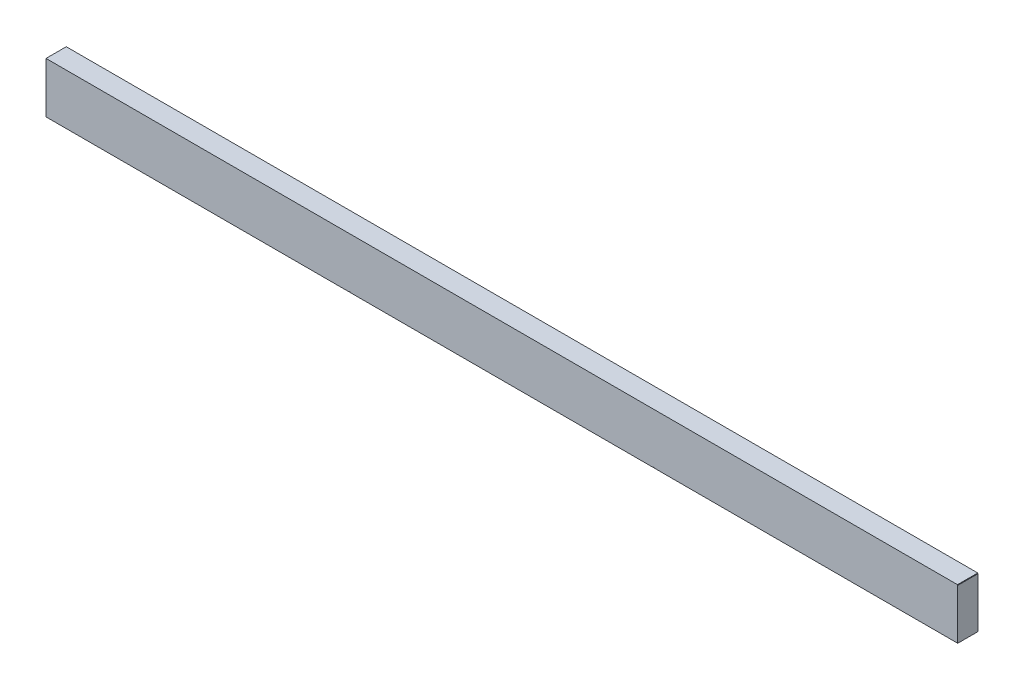
ISO-10303-21;
HEADER;
FILE_DESCRIPTION(('STEP AP214'),'2;1');
FILE_NAME('part.step','',(''),(''),'','','');
FILE_SCHEMA(('AUTOMOTIVE_DESIGN { 1 0 10303 214 1 1 1 1 }'));
ENDSEC;
DATA;
#1=APPLICATION_CONTEXT('core data for automotive mechanical design processes');
#2=APPLICATION_PROTOCOL_DEFINITION('international standard','automotive_design',2000,#1);
#3=PRODUCT_CONTEXT('',#1,'mechanical');
#4=PRODUCT('Part','Part','',(#3));
#5=PRODUCT_RELATED_PRODUCT_CATEGORY('part','',(#4));
#6=PRODUCT_DEFINITION_FORMATION('','',#4);
#7=PRODUCT_DEFINITION_CONTEXT('part definition',#1,'design');
#8=PRODUCT_DEFINITION('design','',#6,#7);
#9=PRODUCT_DEFINITION_SHAPE('','',#8);
#10=(LENGTH_UNIT() NAMED_UNIT(*) SI_UNIT(.MILLI.,.METRE.));
#11=(NAMED_UNIT(*) PLANE_ANGLE_UNIT() SI_UNIT($,.RADIAN.));
#12=(NAMED_UNIT(*) SI_UNIT($,.STERADIAN.) SOLID_ANGLE_UNIT());
#13=UNCERTAINTY_MEASURE_WITH_UNIT(LENGTH_MEASURE(1.E-05),#10,'distance_accuracy_value','');
#14=(GEOMETRIC_REPRESENTATION_CONTEXT(3) GLOBAL_UNCERTAINTY_ASSIGNED_CONTEXT((#13)) GLOBAL_UNIT_ASSIGNED_CONTEXT((#10,
#11,#12)) REPRESENTATION_CONTEXT('',''));
#15=CARTESIAN_POINT('',(0.,0.,0.));
#16=DIRECTION('',(0.,0.,1.));
#17=DIRECTION('',(1.,0.,0.));
#18=AXIS2_PLACEMENT_3D('',#15,#16,#17);
#19=CARTESIAN_POINT('',(9000.,-250.,100.));
#20=DIRECTION('',(0.,1.,0.));
#21=DIRECTION('',(0.,0.,1.));
#22=AXIS2_PLACEMENT_3D('',#19,#20,#21);
#23=PLANE('',#22);
#24=DIRECTION('',(-1.,0.,0.));
#25=VECTOR('',#24,1.);
#26=CARTESIAN_POINT('',(9000.,-250.,100.));
#27=LINE('',#26,#25);
#28=CARTESIAN_POINT('',(5997.5,-250.,100.));
#29=VERTEX_POINT('',#28);
#30=CARTESIAN_POINT('',(3002.5,-250.,100.));
#31=VERTEX_POINT('',#30);
#32=EDGE_CURVE('E269',#29,#31,#27,.T.);
#33=ORIENTED_EDGE('',*,*,#32,.T.);
#34=DIRECTION('',(0.,0.,-1.));
#35=VECTOR('',#34,1.);
#36=CARTESIAN_POINT('',(3002.5,-250.,100.));
#37=LINE('',#36,#35);
#38=CARTESIAN_POINT('',(3002.5,-250.,-100.));
#39=VERTEX_POINT('',#38);
#40=EDGE_CURVE('E11',#31,#39,#37,.T.);
#41=ORIENTED_EDGE('',*,*,#40,.T.);
#42=DIRECTION('',(-1.,0.,0.));
#43=VECTOR('',#42,1.);
#44=CARTESIAN_POINT('',(9000.,-250.,-100.));
#45=LINE('',#44,#43);
#46=CARTESIAN_POINT('',(5997.5,-250.,-100.));
#47=VERTEX_POINT('',#46);
#48=EDGE_CURVE('E168',#47,#39,#45,.T.);
#49=ORIENTED_EDGE('',*,*,#48,.F.);
#50=DIRECTION('',(0.,0.,1.));
#51=VECTOR('',#50,1.);
#52=CARTESIAN_POINT('',(5997.5,-250.,100.));
#53=LINE('',#52,#51);
#54=EDGE_CURVE('E279',#47,#29,#53,.T.);
#55=ORIENTED_EDGE('',*,*,#54,.T.);
#56=EDGE_LOOP('',(#33,#41,#49,#55));
#57=FACE_BOUND('',#56,.T.);
#58=ADVANCED_FACE('F42',(#57),#23,.F.);
#59=CARTESIAN_POINT('',(9000.,-250.,100.));
#60=VERTEX_POINT('',#59);
#61=CARTESIAN_POINT('',(6002.5,-250.,100.));
#62=VERTEX_POINT('',#61);
#63=EDGE_CURVE('E264',#60,#62,#27,.T.);
#64=ORIENTED_EDGE('',*,*,#63,.T.);
#65=DIRECTION('',(0.,0.,-1.));
#66=VECTOR('',#65,1.);
#67=CARTESIAN_POINT('',(6002.5,-250.,100.));
#68=LINE('',#67,#66);
#69=CARTESIAN_POINT('',(6002.5,-250.,-100.));
#70=VERTEX_POINT('',#69);
#71=EDGE_CURVE('E282',#62,#70,#68,.T.);
#72=ORIENTED_EDGE('',*,*,#71,.T.);
#73=CARTESIAN_POINT('',(9000.,-250.,-100.));
#74=VERTEX_POINT('',#73);
#75=EDGE_CURVE('E259',#74,#70,#45,.T.);
#76=ORIENTED_EDGE('',*,*,#75,.F.);
#77=DIRECTION('',(0.,0.,-1.));
#78=VECTOR('',#77,1.);
#79=CARTESIAN_POINT('',(9000.,-250.,100.));
#80=LINE('',#79,#78);
#81=EDGE_CURVE('E241',#60,#74,#80,.T.);
#82=ORIENTED_EDGE('',*,*,#81,.F.);
#83=EDGE_LOOP('',(#64,#72,#76,#82));
#84=FACE_BOUND('',#83,.T.);
#85=ADVANCED_FACE('F310',(#84),#23,.F.);
#86=CARTESIAN_POINT('',(9000.,-250.,-100.));
#87=DIRECTION('',(0.,0.,1.));
#88=DIRECTION('',(1.,0.,0.));
#89=AXIS2_PLACEMENT_3D('',#86,#87,#88);
#90=PLANE('',#89);
#91=ORIENTED_EDGE('',*,*,#48,.T.);
#92=DIRECTION('',(0.,1.,0.));
#93=VECTOR('',#92,1.);
#94=CARTESIAN_POINT('',(3002.5,-255.,-100.));
#95=LINE('',#94,#93);
#96=CARTESIAN_POINT('',(3002.5,-245.,-100.));
#97=VERTEX_POINT('',#96);
#98=EDGE_CURVE('E147',#39,#97,#95,.T.);
#99=ORIENTED_EDGE('',*,*,#98,.T.);
#100=DIRECTION('',(-1.,0.,0.));
#101=VECTOR('',#100,1.);
#102=CARTESIAN_POINT('',(2997.5,-245.,-100.));
#103=LINE('',#102,#101);
#104=CARTESIAN_POINT('',(2997.5,-245.,-100.));
#105=VERTEX_POINT('',#104);
#106=EDGE_CURVE('E158',#97,#105,#103,.T.);
#107=ORIENTED_EDGE('',*,*,#106,.T.);
#108=DIRECTION('',(0.,-1.,0.));
#109=VECTOR('',#108,1.);
#110=CARTESIAN_POINT('',(2997.5,-255.,-100.));
#111=LINE('',#110,#109);
#112=CARTESIAN_POINT('',(2997.5,-250.,-100.));
#113=VERTEX_POINT('',#112);
#114=EDGE_CURVE('E155',#105,#113,#111,.T.);
#115=ORIENTED_EDGE('',*,*,#114,.T.);
#116=CARTESIAN_POINT('',(0.,-250.,-100.));
#117=VERTEX_POINT('',#116);
#118=EDGE_CURVE('E244',#113,#117,#45,.T.);
#119=ORIENTED_EDGE('',*,*,#118,.T.);
#120=DIRECTION('',(0.,1.,0.));
#121=VECTOR('',#120,1.);
#122=CARTESIAN_POINT('',(0.,-250.,-100.));
#123=LINE('',#122,#121);
#124=CARTESIAN_POINT('',(0.,250.,-100.));
#125=VERTEX_POINT('',#124);
#126=EDGE_CURVE('E232',#117,#125,#123,.T.);
#127=ORIENTED_EDGE('',*,*,#126,.T.);
#128=DIRECTION('',(-1.,0.,0.));
#129=VECTOR('',#128,1.);
#130=CARTESIAN_POINT('',(9000.,250.,-100.));
#131=LINE('',#130,#129);
#132=CARTESIAN_POINT('',(8997.5,250.,-100.));
#133=VERTEX_POINT('',#132);
#134=EDGE_CURVE('E272',#133,#125,#131,.T.);
#135=ORIENTED_EDGE('',*,*,#134,.F.);
#136=DIRECTION('',(0.,-1.,0.));
#137=VECTOR('',#136,1.);
#138=CARTESIAN_POINT('',(8997.5,245.,-100.));
#139=LINE('',#138,#137);
#140=CARTESIAN_POINT('',(8997.5,245.,-100.));
#141=VERTEX_POINT('',#140);
#142=EDGE_CURVE('E220',#133,#141,#139,.T.);
#143=ORIENTED_EDGE('',*,*,#142,.T.);
#144=DIRECTION('',(1.,0.,0.));
#145=VECTOR('',#144,1.);
#146=CARTESIAN_POINT('',(8997.5,245.,-100.));
#147=LINE('',#146,#145);
#148=CARTESIAN_POINT('',(9000.,245.,-100.));
#149=VERTEX_POINT('',#148);
#150=EDGE_CURVE('E216',#141,#149,#147,.T.);
#151=ORIENTED_EDGE('',*,*,#150,.T.);
#152=DIRECTION('',(0.,1.,0.));
#153=VECTOR('',#152,1.);
#154=CARTESIAN_POINT('',(9000.,-250.,-100.));
#155=LINE('',#154,#153);
#156=EDGE_CURVE('E233',#74,#149,#155,.T.);
#157=ORIENTED_EDGE('',*,*,#156,.F.);
#158=ORIENTED_EDGE('',*,*,#75,.T.);
#159=DIRECTION('',(0.,1.,0.));
#160=VECTOR('',#159,1.);
#161=CARTESIAN_POINT('',(6002.5,-255.000000000001,-100.));
#162=LINE('',#161,#160);
#163=CARTESIAN_POINT('',(6002.5,-245.000000000001,-100.));
#164=VERTEX_POINT('',#163);
#165=EDGE_CURVE('E197',#70,#164,#162,.T.);
#166=ORIENTED_EDGE('',*,*,#165,.T.);
#167=DIRECTION('',(-1.,0.,0.));
#168=VECTOR('',#167,1.);
#169=CARTESIAN_POINT('',(5997.5,-245.000000000001,-100.));
#170=LINE('',#169,#168);
#171=CARTESIAN_POINT('',(5997.5,-245.000000000001,-100.));
#172=VERTEX_POINT('',#171);
#173=EDGE_CURVE('E205',#164,#172,#170,.T.);
#174=ORIENTED_EDGE('',*,*,#173,.T.);
#175=DIRECTION('',(0.,-1.,0.));
#176=VECTOR('',#175,1.);
#177=CARTESIAN_POINT('',(5997.5,-255.000000000001,-100.));
#178=LINE('',#177,#176);
#179=EDGE_CURVE('E189',#172,#47,#178,.T.);
#180=ORIENTED_EDGE('',*,*,#179,.T.);
#181=EDGE_LOOP('',(#91,#99,#107,#115,#119,#127,#135,#143,#151,#157,#158,#166,#174,#180));
#182=FACE_BOUND('',#181,.T.);
#183=ADVANCED_FACE('F44',(#182),#90,.F.);
#184=CARTESIAN_POINT('',(9000.,250.,100.));
#185=DIRECTION('',(0.,-1.,0.));
#186=DIRECTION('',(0.,0.,-1.));
#187=AXIS2_PLACEMENT_3D('',#184,#185,#186);
#188=PLANE('',#187);
#189=DIRECTION('',(-1.,0.,0.));
#190=VECTOR('',#189,1.);
#191=CARTESIAN_POINT('',(9000.,250.,100.));
#192=LINE('',#191,#190);
#193=CARTESIAN_POINT('',(8997.5,250.,100.));
#194=VERTEX_POINT('',#193);
#195=CARTESIAN_POINT('',(0.,250.,100.));
#196=VERTEX_POINT('',#195);
#197=EDGE_CURVE('E268',#194,#196,#192,.T.);
#198=ORIENTED_EDGE('',*,*,#197,.F.);
#199=DIRECTION('',(0.,0.,-1.));
#200=VECTOR('',#199,1.);
#201=CARTESIAN_POINT('',(8997.5,250.,100.));
#202=LINE('',#201,#200);
#203=EDGE_CURVE('E183',#194,#133,#202,.T.);
#204=ORIENTED_EDGE('',*,*,#203,.T.);
#205=ORIENTED_EDGE('',*,*,#134,.T.);
#206=DIRECTION('',(0.,0.,1.));
#207=VECTOR('',#206,1.);
#208=CARTESIAN_POINT('',(0.,250.,100.));
#209=LINE('',#208,#207);
#210=EDGE_CURVE('E248',#125,#196,#209,.T.);
#211=ORIENTED_EDGE('',*,*,#210,.T.);
#212=EDGE_LOOP('',(#198,#204,#205,#211));
#213=FACE_BOUND('',#212,.T.);
#214=ADVANCED_FACE('F326',(#213),#188,.F.);
#215=CARTESIAN_POINT('',(9000.,-250.,100.));
#216=DIRECTION('',(0.,0.,-1.));
#217=DIRECTION('',(-1.,0.,0.));
#218=AXIS2_PLACEMENT_3D('',#215,#216,#217);
#219=PLANE('',#218);
#220=DIRECTION('',(-1.,0.,0.));
#221=VECTOR('',#220,1.);
#222=CARTESIAN_POINT('',(2997.5,-245.,100.));
#223=LINE('',#222,#221);
#224=CARTESIAN_POINT('',(3002.5,-245.,100.));
#225=VERTEX_POINT('',#224);
#226=CARTESIAN_POINT('',(2997.5,-245.,100.));
#227=VERTEX_POINT('',#226);
#228=EDGE_CURVE('E172',#225,#227,#223,.T.);
#229=ORIENTED_EDGE('',*,*,#228,.F.);
#230=DIRECTION('',(0.,1.,0.));
#231=VECTOR('',#230,1.);
#232=CARTESIAN_POINT('',(3002.5,-255.,100.));
#233=LINE('',#232,#231);
#234=EDGE_CURVE('E149',#31,#225,#233,.T.);
#235=ORIENTED_EDGE('',*,*,#234,.F.);
#236=ORIENTED_EDGE('',*,*,#32,.F.);
#237=DIRECTION('',(0.,-1.,0.));
#238=VECTOR('',#237,1.);
#239=CARTESIAN_POINT('',(5997.5,-255.000000000001,100.));
#240=LINE('',#239,#238);
#241=CARTESIAN_POINT('',(5997.5,-245.000000000001,100.));
#242=VERTEX_POINT('',#241);
#243=EDGE_CURVE('E66',#242,#29,#240,.T.);
#244=ORIENTED_EDGE('',*,*,#243,.F.);
#245=DIRECTION('',(-1.,0.,0.));
#246=VECTOR('',#245,1.);
#247=CARTESIAN_POINT('',(5997.5,-245.000000000001,100.));
#248=LINE('',#247,#246);
#249=CARTESIAN_POINT('',(6002.5,-245.000000000001,100.));
#250=VERTEX_POINT('',#249);
#251=EDGE_CURVE('E196',#250,#242,#248,.T.);
#252=ORIENTED_EDGE('',*,*,#251,.F.);
#253=DIRECTION('',(0.,1.,0.));
#254=VECTOR('',#253,1.);
#255=CARTESIAN_POINT('',(6002.5,-255.000000000001,100.));
#256=LINE('',#255,#254);
#257=EDGE_CURVE('E179',#62,#250,#256,.T.);
#258=ORIENTED_EDGE('',*,*,#257,.F.);
#259=ORIENTED_EDGE('',*,*,#63,.F.);
#260=DIRECTION('',(0.,-1.,0.));
#261=VECTOR('',#260,1.);
#262=CARTESIAN_POINT('',(9000.,-250.,100.));
#263=LINE('',#262,#261);
#264=CARTESIAN_POINT('',(9000.,245.,100.));
#265=VERTEX_POINT('',#264);
#266=EDGE_CURVE('E237',#265,#60,#263,.T.);
#267=ORIENTED_EDGE('',*,*,#266,.F.);
#268=DIRECTION('',(1.,0.,0.));
#269=VECTOR('',#268,1.);
#270=CARTESIAN_POINT('',(8997.5,245.,100.));
#271=LINE('',#270,#269);
#272=CARTESIAN_POINT('',(8997.5,245.,100.));
#273=VERTEX_POINT('',#272);
#274=EDGE_CURVE('E217',#273,#265,#271,.T.);
#275=ORIENTED_EDGE('',*,*,#274,.F.);
#276=DIRECTION('',(0.,-1.,0.));
#277=VECTOR('',#276,1.);
#278=CARTESIAN_POINT('',(8997.5,245.,100.));
#279=LINE('',#278,#277);
#280=EDGE_CURVE('E193',#194,#273,#279,.T.);
#281=ORIENTED_EDGE('',*,*,#280,.F.);
#282=ORIENTED_EDGE('',*,*,#197,.T.);
#283=DIRECTION('',(0.,-1.,0.));
#284=VECTOR('',#283,1.);
#285=CARTESIAN_POINT('',(0.,-250.,100.));
#286=LINE('',#285,#284);
#287=CARTESIAN_POINT('',(0.,-250.,100.));
#288=VERTEX_POINT('',#287);
#289=EDGE_CURVE('E252',#196,#288,#286,.T.);
#290=ORIENTED_EDGE('',*,*,#289,.T.);
#291=CARTESIAN_POINT('',(2997.5,-250.,100.));
#292=VERTEX_POINT('',#291);
#293=EDGE_CURVE('E263',#292,#288,#27,.T.);
#294=ORIENTED_EDGE('',*,*,#293,.F.);
#295=DIRECTION('',(0.,-1.,0.));
#296=VECTOR('',#295,1.);
#297=CARTESIAN_POINT('',(2997.5,-255.,100.));
#298=LINE('',#297,#296);
#299=EDGE_CURVE('E58',#227,#292,#298,.T.);
#300=ORIENTED_EDGE('',*,*,#299,.F.);
#301=EDGE_LOOP('',(#229,#235,#236,#244,#252,#258,#259,#267,#275,#281,#282,#290,#294,#300));
#302=FACE_BOUND('',#301,.T.);
#303=ADVANCED_FACE('F291',(#302),#219,.F.);
#304=ORIENTED_EDGE('',*,*,#118,.F.);
#305=DIRECTION('',(0.,0.,1.));
#306=VECTOR('',#305,1.);
#307=CARTESIAN_POINT('',(2997.5,-250.,100.));
#308=LINE('',#307,#306);
#309=EDGE_CURVE('E51',#113,#292,#308,.T.);
#310=ORIENTED_EDGE('',*,*,#309,.T.);
#311=ORIENTED_EDGE('',*,*,#293,.T.);
#312=DIRECTION('',(0.,0.,-1.));
#313=VECTOR('',#312,1.);
#314=CARTESIAN_POINT('',(0.,-250.,100.));
#315=LINE('',#314,#313);
#316=EDGE_CURVE('E238',#288,#117,#315,.T.);
#317=ORIENTED_EDGE('',*,*,#316,.T.);
#318=EDGE_LOOP('',(#304,#310,#311,#317));
#319=FACE_BOUND('',#318,.T.);
#320=ADVANCED_FACE('F289',(#319),#23,.F.);
#321=CARTESIAN_POINT('',(9000.,0.,0.));
#322=DIRECTION('',(-1.,0.,0.));
#323=DIRECTION('',(0.,0.,1.));
#324=AXIS2_PLACEMENT_3D('',#321,#322,#323);
#325=PLANE('',#324);
#326=ORIENTED_EDGE('',*,*,#156,.T.);
#327=DIRECTION('',(0.,0.,1.));
#328=VECTOR('',#327,1.);
#329=CARTESIAN_POINT('',(9000.,245.,0.));
#330=LINE('',#329,#328);
#331=EDGE_CURVE('E275',#149,#265,#330,.T.);
#332=ORIENTED_EDGE('',*,*,#331,.T.);
#333=ORIENTED_EDGE('',*,*,#266,.T.);
#334=ORIENTED_EDGE('',*,*,#81,.T.);
#335=EDGE_LOOP('',(#326,#332,#333,#334));
#336=FACE_BOUND('',#335,.T.);
#337=ADVANCED_FACE('F315',(#336),#325,.F.);
#338=CARTESIAN_POINT('',(0.,0.,0.));
#339=DIRECTION('',(-1.,0.,0.));
#340=DIRECTION('',(0.,0.,1.));
#341=AXIS2_PLACEMENT_3D('',#338,#339,#340);
#342=PLANE('',#341);
#343=ORIENTED_EDGE('',*,*,#126,.F.);
#344=ORIENTED_EDGE('',*,*,#316,.F.);
#345=ORIENTED_EDGE('',*,*,#289,.F.);
#346=ORIENTED_EDGE('',*,*,#210,.F.);
#347=EDGE_LOOP('',(#343,#344,#345,#346));
#348=FACE_BOUND('',#347,.T.);
#349=ADVANCED_FACE('F330',(#348),#342,.T.);
#350=CARTESIAN_POINT('',(8997.5,245.,-100.));
#351=DIRECTION('',(-1.,0.,0.));
#352=DIRECTION('',(0.,0.,1.));
#353=AXIS2_PLACEMENT_3D('',#350,#351,#352);
#354=PLANE('',#353);
#355=ORIENTED_EDGE('',*,*,#280,.T.);
#356=DIRECTION('',(0.,0.,1.));
#357=VECTOR('',#356,1.);
#358=CARTESIAN_POINT('',(8997.5,245.,-100.));
#359=LINE('',#358,#357);
#360=EDGE_CURVE('E212',#141,#273,#359,.T.);
#361=ORIENTED_EDGE('',*,*,#360,.F.);
#362=ORIENTED_EDGE('',*,*,#142,.F.);
#363=ORIENTED_EDGE('',*,*,#203,.F.);
#364=EDGE_LOOP('',(#355,#361,#362,#363));
#365=FACE_BOUND('',#364,.T.);
#366=ADVANCED_FACE('F323',(#365),#354,.F.);
#367=CARTESIAN_POINT('',(8997.5,245.,-100.));
#368=DIRECTION('',(0.,-1.,0.));
#369=DIRECTION('',(1.,0.,0.));
#370=AXIS2_PLACEMENT_3D('',#367,#368,#369);
#371=PLANE('',#370);
#372=ORIENTED_EDGE('',*,*,#150,.F.);
#373=ORIENTED_EDGE('',*,*,#360,.T.);
#374=ORIENTED_EDGE('',*,*,#274,.T.);
#375=ORIENTED_EDGE('',*,*,#331,.F.);
#376=EDGE_LOOP('',(#372,#373,#374,#375));
#377=FACE_BOUND('',#376,.T.);
#378=ADVANCED_FACE('F321',(#377),#371,.F.);
#379=CARTESIAN_POINT('',(6002.5,-255.000000000001,-100.));
#380=DIRECTION('',(1.,0.,0.));
#381=DIRECTION('',(0.,0.,-1.));
#382=AXIS2_PLACEMENT_3D('',#379,#380,#381);
#383=PLANE('',#382);
#384=ORIENTED_EDGE('',*,*,#257,.T.);
#385=DIRECTION('',(0.,0.,1.));
#386=VECTOR('',#385,1.);
#387=CARTESIAN_POINT('',(6002.5,-245.000000000001,-100.));
#388=LINE('',#387,#386);
#389=EDGE_CURVE('E185',#164,#250,#388,.T.);
#390=ORIENTED_EDGE('',*,*,#389,.F.);
#391=ORIENTED_EDGE('',*,*,#165,.F.);
#392=ORIENTED_EDGE('',*,*,#71,.F.);
#393=EDGE_LOOP('',(#384,#390,#391,#392));
#394=FACE_BOUND('',#393,.T.);
#395=ADVANCED_FACE('F307',(#394),#383,.F.);
#396=CARTESIAN_POINT('',(5997.5,-255.000000000001,-100.));
#397=DIRECTION('',(-1.,0.,0.));
#398=DIRECTION('',(0.,0.,1.));
#399=AXIS2_PLACEMENT_3D('',#396,#397,#398);
#400=PLANE('',#399);
#401=ORIENTED_EDGE('',*,*,#179,.F.);
#402=DIRECTION('',(0.,0.,1.));
#403=VECTOR('',#402,1.);
#404=CARTESIAN_POINT('',(5997.5,-245.000000000001,-100.));
#405=LINE('',#404,#403);
#406=EDGE_CURVE('E190',#172,#242,#405,.T.);
#407=ORIENTED_EDGE('',*,*,#406,.T.);
#408=ORIENTED_EDGE('',*,*,#243,.T.);
#409=ORIENTED_EDGE('',*,*,#54,.F.);
#410=EDGE_LOOP('',(#401,#407,#408,#409));
#411=FACE_BOUND('',#410,.T.);
#412=ADVANCED_FACE('F395',(#411),#400,.F.);
#413=CARTESIAN_POINT('',(5997.5,-245.000000000001,-100.));
#414=DIRECTION('',(0.,1.,0.));
#415=DIRECTION('',(0.,0.,1.));
#416=AXIS2_PLACEMENT_3D('',#413,#414,#415);
#417=PLANE('',#416);
#418=ORIENTED_EDGE('',*,*,#251,.T.);
#419=ORIENTED_EDGE('',*,*,#406,.F.);
#420=ORIENTED_EDGE('',*,*,#173,.F.);
#421=ORIENTED_EDGE('',*,*,#389,.T.);
#422=EDGE_LOOP('',(#418,#419,#420,#421));
#423=FACE_BOUND('',#422,.T.);
#424=ADVANCED_FACE('F303',(#423),#417,.F.);
#425=CARTESIAN_POINT('',(3002.5,-255.,-100.));
#426=DIRECTION('',(1.,0.,0.));
#427=DIRECTION('',(0.,0.,-1.));
#428=AXIS2_PLACEMENT_3D('',#425,#426,#427);
#429=PLANE('',#428);
#430=ORIENTED_EDGE('',*,*,#234,.T.);
#431=DIRECTION('',(0.,0.,1.));
#432=VECTOR('',#431,1.);
#433=CARTESIAN_POINT('',(3002.5,-245.,-100.));
#434=LINE('',#433,#432);
#435=EDGE_CURVE('E143',#97,#225,#434,.T.);
#436=ORIENTED_EDGE('',*,*,#435,.F.);
#437=ORIENTED_EDGE('',*,*,#98,.F.);
#438=ORIENTED_EDGE('',*,*,#40,.F.);
#439=EDGE_LOOP('',(#430,#436,#437,#438));
#440=FACE_BOUND('',#439,.T.);
#441=ADVANCED_FACE('F145',(#440),#429,.F.);
#442=CARTESIAN_POINT('',(2997.5,-255.,-100.));
#443=DIRECTION('',(-1.,0.,0.));
#444=DIRECTION('',(0.,0.,1.));
#445=AXIS2_PLACEMENT_3D('',#442,#443,#444);
#446=PLANE('',#445);
#447=ORIENTED_EDGE('',*,*,#114,.F.);
#448=DIRECTION('',(0.,0.,1.));
#449=VECTOR('',#448,1.);
#450=CARTESIAN_POINT('',(2997.5,-245.,-100.));
#451=LINE('',#450,#449);
#452=EDGE_CURVE('E154',#105,#227,#451,.T.);
#453=ORIENTED_EDGE('',*,*,#452,.T.);
#454=ORIENTED_EDGE('',*,*,#299,.T.);
#455=ORIENTED_EDGE('',*,*,#309,.F.);
#456=EDGE_LOOP('',(#447,#453,#454,#455));
#457=FACE_BOUND('',#456,.T.);
#458=ADVANCED_FACE('F420',(#457),#446,.F.);
#459=CARTESIAN_POINT('',(2997.5,-245.,-100.));
#460=DIRECTION('',(0.,1.,0.));
#461=DIRECTION('',(0.,0.,1.));
#462=AXIS2_PLACEMENT_3D('',#459,#460,#461);
#463=PLANE('',#462);
#464=ORIENTED_EDGE('',*,*,#228,.T.);
#465=ORIENTED_EDGE('',*,*,#452,.F.);
#466=ORIENTED_EDGE('',*,*,#106,.F.);
#467=ORIENTED_EDGE('',*,*,#435,.T.);
#468=EDGE_LOOP('',(#464,#465,#466,#467));
#469=FACE_BOUND('',#468,.T.);
#470=ADVANCED_FACE('F159',(#469),#463,.F.);
#471=CLOSED_SHELL('',(#58,#85,#183,#214,#303,#320,#337,#349,#366,#378,#395,#412,#424,#441,#458,#470));
#472=MANIFOLD_SOLID_BREP('B2',#471);
#473=ADVANCED_BREP_SHAPE_REPRESENTATION('',(#18,#472),#14);
#474=SHAPE_DEFINITION_REPRESENTATION(#9,#473);
ENDSEC;
END-ISO-10303-21;
